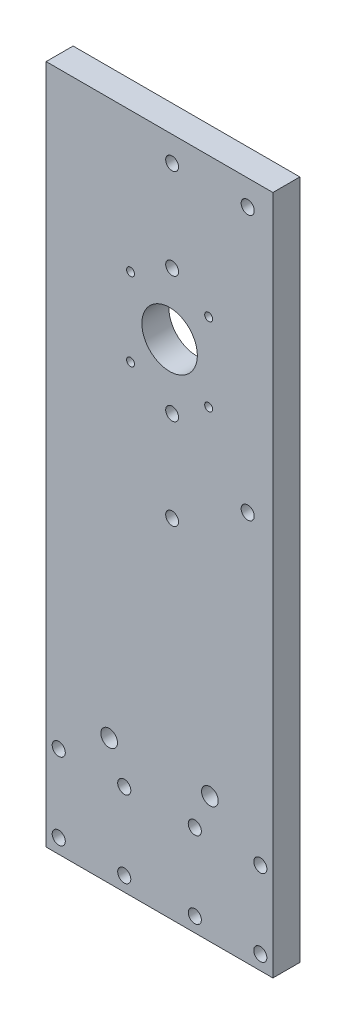
ISO-10303-21;
HEADER;
FILE_DESCRIPTION(('STEP AP214'),'2;1');
FILE_NAME('part.step','',(''),(''),'','','');
FILE_SCHEMA(('AUTOMOTIVE_DESIGN { 1 0 10303 214 1 1 1 1 }'));
ENDSEC;
DATA;
#1=APPLICATION_CONTEXT('core data for automotive mechanical design processes');
#2=APPLICATION_PROTOCOL_DEFINITION('international standard','automotive_design',2000,#1);
#3=PRODUCT_CONTEXT('',#1,'mechanical');
#4=PRODUCT('Part','Part','',(#3));
#5=PRODUCT_RELATED_PRODUCT_CATEGORY('part','',(#4));
#6=PRODUCT_DEFINITION_FORMATION('','',#4);
#7=PRODUCT_DEFINITION_CONTEXT('part definition',#1,'design');
#8=PRODUCT_DEFINITION('design','',#6,#7);
#9=PRODUCT_DEFINITION_SHAPE('','',#8);
#10=(LENGTH_UNIT() NAMED_UNIT(*) SI_UNIT(.MILLI.,.METRE.));
#11=(NAMED_UNIT(*) PLANE_ANGLE_UNIT() SI_UNIT($,.RADIAN.));
#12=(NAMED_UNIT(*) SI_UNIT($,.STERADIAN.) SOLID_ANGLE_UNIT());
#13=UNCERTAINTY_MEASURE_WITH_UNIT(LENGTH_MEASURE(1.E-05),#10,'distance_accuracy_value','');
#14=(GEOMETRIC_REPRESENTATION_CONTEXT(3) GLOBAL_UNCERTAINTY_ASSIGNED_CONTEXT((#13)) GLOBAL_UNIT_ASSIGNED_CONTEXT((#10,
#11,#12)) REPRESENTATION_CONTEXT('',''));
#15=CARTESIAN_POINT('',(0.,0.,0.));
#16=DIRECTION('',(0.,0.,1.));
#17=DIRECTION('',(1.,0.,0.));
#18=AXIS2_PLACEMENT_3D('',#15,#16,#17);
#19=CARTESIAN_POINT('',(0.,0.,0.));
#20=DIRECTION('',(0.,0.,1.));
#21=DIRECTION('',(1.,0.,0.));
#22=AXIS2_PLACEMENT_3D('',#19,#20,#21);
#23=PLANE('',#22);
#24=CARTESIAN_POINT('',(19.5,79.5,0.));
#25=DIRECTION('',(0.,0.,-1.));
#26=DIRECTION('',(-1.,0.,0.));
#27=AXIS2_PLACEMENT_3D('',#24,#25,#26);
#28=CIRCLE('',#27,1.575);
#29=CARTESIAN_POINT('',(17.925,79.5,0.));
#30=VERTEX_POINT('',#29);
#31=EDGE_CURVE('E239',#30,#30,#28,.T.);
#32=ORIENTED_EDGE('',*,*,#31,.F.);
#33=EDGE_LOOP('',(#32));
#34=FACE_BOUND('',#33,.T.);
#35=CARTESIAN_POINT('',(19.5,48.5,0.));
#36=DIRECTION('',(0.,0.,-1.));
#37=DIRECTION('',(-1.,0.,0.));
#38=AXIS2_PLACEMENT_3D('',#35,#36,#37);
#39=CIRCLE('',#38,1.575);
#40=CARTESIAN_POINT('',(17.925,48.5,0.));
#41=VERTEX_POINT('',#40);
#42=EDGE_CURVE('E233',#41,#41,#39,.T.);
#43=ORIENTED_EDGE('',*,*,#42,.F.);
#44=EDGE_LOOP('',(#43));
#45=FACE_BOUND('',#44,.T.);
#46=CARTESIAN_POINT('',(-11.5,79.5,0.));
#47=DIRECTION('',(0.,0.,-1.));
#48=DIRECTION('',(-1.,0.,0.));
#49=AXIS2_PLACEMENT_3D('',#46,#47,#48);
#50=CIRCLE('',#49,1.575);
#51=CARTESIAN_POINT('',(-13.075,79.5,0.));
#52=VERTEX_POINT('',#51);
#53=EDGE_CURVE('E227',#52,#52,#50,.T.);
#54=ORIENTED_EDGE('',*,*,#53,.F.);
#55=EDGE_LOOP('',(#54));
#56=FACE_BOUND('',#55,.T.);
#57=CARTESIAN_POINT('',(-11.5,48.5,0.));
#58=DIRECTION('',(0.,0.,-1.));
#59=DIRECTION('',(-1.,0.,0.));
#60=AXIS2_PLACEMENT_3D('',#57,#58,#59);
#61=CIRCLE('',#60,1.575);
#62=CARTESIAN_POINT('',(-13.075,48.5,0.));
#63=VERTEX_POINT('',#62);
#64=EDGE_CURVE('E221',#63,#63,#61,.T.);
#65=ORIENTED_EDGE('',*,*,#64,.F.);
#66=EDGE_LOOP('',(#65));
#67=FACE_BOUND('',#66,.T.);
#68=CARTESIAN_POINT('',(4.,64.,0.));
#69=DIRECTION('',(0.,0.,-1.));
#70=DIRECTION('',(-1.,0.,0.));
#71=AXIS2_PLACEMENT_3D('',#68,#69,#70);
#72=CIRCLE('',#71,11.);
#73=CARTESIAN_POINT('',(-7.,64.,0.));
#74=VERTEX_POINT('',#73);
#75=EDGE_CURVE('E213',#74,#74,#72,.T.);
#76=ORIENTED_EDGE('',*,*,#75,.F.);
#77=EDGE_LOOP('',(#76));
#78=FACE_BOUND('',#77,.T.);
#79=CARTESIAN_POINT('',(5.,125.,0.));
#80=DIRECTION('',(0.,0.,-1.));
#81=DIRECTION('',(-1.,0.,0.));
#82=AXIS2_PLACEMENT_3D('',#79,#80,#81);
#83=CIRCLE('',#82,2.5527);
#84=CARTESIAN_POINT('',(2.4473,125.,0.));
#85=VERTEX_POINT('',#84);
#86=EDGE_CURVE('E209',#85,#85,#83,.T.);
#87=ORIENTED_EDGE('',*,*,#86,.F.);
#88=EDGE_LOOP('',(#87));
#89=FACE_BOUND('',#88,.T.);
#90=CARTESIAN_POINT('',(5.,89.,0.));
#91=DIRECTION('',(0.,0.,-1.));
#92=DIRECTION('',(-1.,0.,0.));
#93=AXIS2_PLACEMENT_3D('',#90,#91,#92);
#94=CIRCLE('',#93,2.5527);
#95=CARTESIAN_POINT('',(2.4473,89.,0.));
#96=VERTEX_POINT('',#95);
#97=EDGE_CURVE('E203',#96,#96,#94,.T.);
#98=ORIENTED_EDGE('',*,*,#97,.F.);
#99=EDGE_LOOP('',(#98));
#100=FACE_BOUND('',#99,.T.);
#101=CARTESIAN_POINT('',(5.,39.,0.));
#102=DIRECTION('',(0.,0.,-1.));
#103=DIRECTION('',(-1.,0.,0.));
#104=AXIS2_PLACEMENT_3D('',#101,#102,#103);
#105=CIRCLE('',#104,2.5527);
#106=CARTESIAN_POINT('',(2.4473,39.,0.));
#107=VERTEX_POINT('',#106);
#108=EDGE_CURVE('E197',#107,#107,#105,.T.);
#109=ORIENTED_EDGE('',*,*,#108,.F.);
#110=EDGE_LOOP('',(#109));
#111=FACE_BOUND('',#110,.T.);
#112=CARTESIAN_POINT('',(5.,3.00000000000002,0.));
#113=DIRECTION('',(0.,0.,-1.));
#114=DIRECTION('',(-1.,0.,0.));
#115=AXIS2_PLACEMENT_3D('',#112,#113,#114);
#116=CIRCLE('',#115,2.5527);
#117=CARTESIAN_POINT('',(2.4473,3.00000000000002,0.));
#118=VERTEX_POINT('',#117);
#119=EDGE_CURVE('E191',#118,#118,#116,.T.);
#120=ORIENTED_EDGE('',*,*,#119,.F.);
#121=EDGE_LOOP('',(#120));
#122=FACE_BOUND('',#121,.T.);
#123=CARTESIAN_POINT('',(35.,20.,0.));
#124=DIRECTION('',(0.,0.,-1.));
#125=DIRECTION('',(-1.,0.,0.));
#126=AXIS2_PLACEMENT_3D('',#123,#124,#125);
#127=CIRCLE('',#126,2.6);
#128=CARTESIAN_POINT('',(32.4,20.,0.));
#129=VERTEX_POINT('',#128);
#130=EDGE_CURVE('E179',#129,#129,#127,.T.);
#131=ORIENTED_EDGE('',*,*,#130,.F.);
#132=EDGE_LOOP('',(#131));
#133=FACE_BOUND('',#132,.T.);
#134=CARTESIAN_POINT('',(20.,-85.,0.));
#135=DIRECTION('',(0.,0.,-1.));
#136=DIRECTION('',(-1.,0.,0.));
#137=AXIS2_PLACEMENT_3D('',#134,#135,#136);
#138=CIRCLE('',#137,3.3147);
#139=CARTESIAN_POINT('',(16.6853,-85.,0.));
#140=VERTEX_POINT('',#139);
#141=EDGE_CURVE('E173',#140,#140,#138,.T.);
#142=ORIENTED_EDGE('',*,*,#141,.F.);
#143=EDGE_LOOP('',(#142));
#144=FACE_BOUND('',#143,.T.);
#145=CARTESIAN_POINT('',(-20.,-85.,0.));
#146=DIRECTION('',(0.,0.,-1.));
#147=DIRECTION('',(-1.,0.,0.));
#148=AXIS2_PLACEMENT_3D('',#145,#146,#147);
#149=CIRCLE('',#148,3.3147);
#150=CARTESIAN_POINT('',(-23.3147,-85.,0.));
#151=VERTEX_POINT('',#150);
#152=EDGE_CURVE('E167',#151,#151,#149,.T.);
#153=ORIENTED_EDGE('',*,*,#152,.F.);
#154=EDGE_LOOP('',(#153));
#155=FACE_BOUND('',#154,.T.);
#156=CARTESIAN_POINT('',(40.,-98.75,0.));
#157=DIRECTION('',(0.,0.,-1.));
#158=DIRECTION('',(-1.,0.,0.));
#159=AXIS2_PLACEMENT_3D('',#156,#157,#158);
#160=CIRCLE('',#159,2.59999999999998);
#161=CARTESIAN_POINT('',(37.4,-98.75,0.));
#162=VERTEX_POINT('',#161);
#163=EDGE_CURVE('E161',#162,#162,#160,.T.);
#164=ORIENTED_EDGE('',*,*,#163,.F.);
#165=EDGE_LOOP('',(#164));
#166=FACE_BOUND('',#165,.T.);
#167=CARTESIAN_POINT('',(14.,-98.75,0.));
#168=DIRECTION('',(0.,0.,-1.));
#169=DIRECTION('',(-1.,0.,0.));
#170=AXIS2_PLACEMENT_3D('',#167,#168,#169);
#171=CIRCLE('',#170,2.59999999999999);
#172=CARTESIAN_POINT('',(11.4,-98.75,0.));
#173=VERTEX_POINT('',#172);
#174=EDGE_CURVE('E155',#173,#173,#171,.T.);
#175=ORIENTED_EDGE('',*,*,#174,.F.);
#176=EDGE_LOOP('',(#175));
#177=FACE_BOUND('',#176,.T.);
#178=CARTESIAN_POINT('',(40.,-129.25,0.));
#179=DIRECTION('',(0.,0.,-1.));
#180=DIRECTION('',(-1.,0.,0.));
#181=AXIS2_PLACEMENT_3D('',#178,#179,#180);
#182=CIRCLE('',#181,2.59999999999998);
#183=CARTESIAN_POINT('',(37.4,-129.25,0.));
#184=VERTEX_POINT('',#183);
#185=EDGE_CURVE('E149',#184,#184,#182,.T.);
#186=ORIENTED_EDGE('',*,*,#185,.F.);
#187=EDGE_LOOP('',(#186));
#188=FACE_BOUND('',#187,.T.);
#189=CARTESIAN_POINT('',(14.,-129.25,0.));
#190=DIRECTION('',(0.,0.,-1.));
#191=DIRECTION('',(-1.,0.,0.));
#192=AXIS2_PLACEMENT_3D('',#189,#190,#191);
#193=CIRCLE('',#192,2.59999999999999);
#194=CARTESIAN_POINT('',(11.4,-129.25,0.));
#195=VERTEX_POINT('',#194);
#196=EDGE_CURVE('E143',#195,#195,#193,.T.);
#197=ORIENTED_EDGE('',*,*,#196,.F.);
#198=EDGE_LOOP('',(#197));
#199=FACE_BOUND('',#198,.T.);
#200=CARTESIAN_POINT('',(-14.,-129.25,0.));
#201=DIRECTION('',(0.,0.,-1.));
#202=DIRECTION('',(-1.,0.,0.));
#203=AXIS2_PLACEMENT_3D('',#200,#201,#202);
#204=CIRCLE('',#203,2.59999999999999);
#205=CARTESIAN_POINT('',(-16.6,-129.25,0.));
#206=VERTEX_POINT('',#205);
#207=EDGE_CURVE('E137',#206,#206,#204,.T.);
#208=ORIENTED_EDGE('',*,*,#207,.F.);
#209=EDGE_LOOP('',(#208));
#210=FACE_BOUND('',#209,.T.);
#211=CARTESIAN_POINT('',(-40.,-129.25,0.));
#212=DIRECTION('',(0.,0.,-1.));
#213=DIRECTION('',(-1.,0.,0.));
#214=AXIS2_PLACEMENT_3D('',#211,#212,#213);
#215=CIRCLE('',#214,2.59999999999998);
#216=CARTESIAN_POINT('',(-42.6,-129.25,0.));
#217=VERTEX_POINT('',#216);
#218=EDGE_CURVE('E131',#217,#217,#215,.T.);
#219=ORIENTED_EDGE('',*,*,#218,.F.);
#220=EDGE_LOOP('',(#219));
#221=FACE_BOUND('',#220,.T.);
#222=CARTESIAN_POINT('',(-14.,-98.75,0.));
#223=DIRECTION('',(0.,0.,-1.));
#224=DIRECTION('',(-1.,0.,0.));
#225=AXIS2_PLACEMENT_3D('',#222,#223,#224);
#226=CIRCLE('',#225,2.59999999999999);
#227=CARTESIAN_POINT('',(-16.6,-98.75,0.));
#228=VERTEX_POINT('',#227);
#229=EDGE_CURVE('E125',#228,#228,#226,.T.);
#230=ORIENTED_EDGE('',*,*,#229,.F.);
#231=EDGE_LOOP('',(#230));
#232=FACE_BOUND('',#231,.T.);
#233=CARTESIAN_POINT('',(-40.,-98.7499999999999,0.));
#234=DIRECTION('',(0.,0.,-1.));
#235=DIRECTION('',(-1.,0.,0.));
#236=AXIS2_PLACEMENT_3D('',#233,#234,#235);
#237=CIRCLE('',#236,2.59999999999998);
#238=CARTESIAN_POINT('',(-42.6,-98.7499999999999,0.));
#239=VERTEX_POINT('',#238);
#240=EDGE_CURVE('E119',#239,#239,#237,.T.);
#241=ORIENTED_EDGE('',*,*,#240,.F.);
#242=EDGE_LOOP('',(#241));
#243=FACE_BOUND('',#242,.T.);
#244=DIRECTION('',(0.,-1.,0.));
#245=VECTOR('',#244,1.);
#246=CARTESIAN_POINT('',(-45.,-135.,0.));
#247=LINE('',#246,#245);
#248=CARTESIAN_POINT('',(-45.,135.,0.));
#249=VERTEX_POINT('',#248);
#250=CARTESIAN_POINT('',(-45.,-135.,0.));
#251=VERTEX_POINT('',#250);
#252=EDGE_CURVE('E103',#249,#251,#247,.T.);
#253=ORIENTED_EDGE('',*,*,#252,.F.);
#254=DIRECTION('',(-1.,0.,0.));
#255=VECTOR('',#254,1.);
#256=CARTESIAN_POINT('',(45.,135.,0.));
#257=LINE('',#256,#255);
#258=CARTESIAN_POINT('',(45.,135.,0.));
#259=VERTEX_POINT('',#258);
#260=EDGE_CURVE('E79',#259,#249,#257,.T.);
#261=ORIENTED_EDGE('',*,*,#260,.F.);
#262=DIRECTION('',(0.,1.,0.));
#263=VECTOR('',#262,1.);
#264=CARTESIAN_POINT('',(45.,-135.,0.));
#265=LINE('',#264,#263);
#266=CARTESIAN_POINT('',(45.,-135.,0.));
#267=VERTEX_POINT('',#266);
#268=EDGE_CURVE('E73',#267,#259,#265,.T.);
#269=ORIENTED_EDGE('',*,*,#268,.F.);
#270=DIRECTION('',(1.,0.,0.));
#271=VECTOR('',#270,1.);
#272=CARTESIAN_POINT('',(45.,-135.,0.));
#273=LINE('',#272,#271);
#274=EDGE_CURVE('E95',#251,#267,#273,.T.);
#275=ORIENTED_EDGE('',*,*,#274,.F.);
#276=EDGE_LOOP('',(#253,#261,#269,#275));
#277=FACE_BOUND('',#276,.T.);
#278=CARTESIAN_POINT('',(35.,125.,0.));
#279=DIRECTION('',(0.,0.,-1.));
#280=DIRECTION('',(-1.,0.,0.));
#281=AXIS2_PLACEMENT_3D('',#278,#279,#280);
#282=CIRCLE('',#281,2.6);
#283=CARTESIAN_POINT('',(32.4,125.,0.));
#284=VERTEX_POINT('',#283);
#285=EDGE_CURVE('E185',#284,#284,#282,.T.);
#286=ORIENTED_EDGE('',*,*,#285,.F.);
#287=EDGE_LOOP('',(#286));
#288=FACE_BOUND('',#287,.T.);
#289=ADVANCED_FACE('F39',(#34,#45,#56,#67,#78,#89,#100,#111,#122,#133,#144,#155,#166,#177,#188,
#199,#210,#221,#232,#243,#277,#288),#23,.F.);
#290=CARTESIAN_POINT('',(-45.,-135.,10.7));
#291=DIRECTION('',(1.,0.,0.));
#292=DIRECTION('',(0.,0.,-1.));
#293=AXIS2_PLACEMENT_3D('',#290,#291,#292);
#294=PLANE('',#293);
#295=ORIENTED_EDGE('',*,*,#252,.T.);
#296=DIRECTION('',(0.,0.,-1.));
#297=VECTOR('',#296,1.);
#298=CARTESIAN_POINT('',(-45.,-135.,10.7));
#299=LINE('',#298,#297);
#300=CARTESIAN_POINT('',(-45.,-135.,10.7));
#301=VERTEX_POINT('',#300);
#302=EDGE_CURVE('E11',#301,#251,#299,.T.);
#303=ORIENTED_EDGE('',*,*,#302,.F.);
#304=DIRECTION('',(0.,-1.,0.));
#305=VECTOR('',#304,1.);
#306=CARTESIAN_POINT('',(-45.,-135.,10.7));
#307=LINE('',#306,#305);
#308=CARTESIAN_POINT('',(-45.,135.,10.7));
#309=VERTEX_POINT('',#308);
#310=EDGE_CURVE('E91',#309,#301,#307,.T.);
#311=ORIENTED_EDGE('',*,*,#310,.F.);
#312=DIRECTION('',(0.,0.,-1.));
#313=VECTOR('',#312,1.);
#314=CARTESIAN_POINT('',(-45.,135.,10.7));
#315=LINE('',#314,#313);
#316=EDGE_CURVE('E99',#309,#249,#315,.T.);
#317=ORIENTED_EDGE('',*,*,#316,.T.);
#318=EDGE_LOOP('',(#295,#303,#311,#317));
#319=FACE_BOUND('',#318,.T.);
#320=ADVANCED_FACE('F41',(#319),#294,.F.);
#321=CARTESIAN_POINT('',(45.,-135.,10.7));
#322=DIRECTION('',(0.,1.,0.));
#323=DIRECTION('',(0.,0.,1.));
#324=AXIS2_PLACEMENT_3D('',#321,#322,#323);
#325=PLANE('',#324);
#326=ORIENTED_EDGE('',*,*,#274,.T.);
#327=DIRECTION('',(0.,0.,-1.));
#328=VECTOR('',#327,1.);
#329=CARTESIAN_POINT('',(45.,-135.,10.7));
#330=LINE('',#329,#328);
#331=CARTESIAN_POINT('',(45.,-135.,10.7));
#332=VERTEX_POINT('',#331);
#333=EDGE_CURVE('E48',#332,#267,#330,.T.);
#334=ORIENTED_EDGE('',*,*,#333,.F.);
#335=DIRECTION('',(1.,0.,0.));
#336=VECTOR('',#335,1.);
#337=CARTESIAN_POINT('',(45.,-135.,10.7));
#338=LINE('',#337,#336);
#339=EDGE_CURVE('E86',#301,#332,#338,.T.);
#340=ORIENTED_EDGE('',*,*,#339,.F.);
#341=ORIENTED_EDGE('',*,*,#302,.T.);
#342=EDGE_LOOP('',(#326,#334,#340,#341));
#343=FACE_BOUND('',#342,.T.);
#344=ADVANCED_FACE('F94',(#343),#325,.F.);
#345=CARTESIAN_POINT('',(45.,-135.,10.7));
#346=DIRECTION('',(-1.,0.,0.));
#347=DIRECTION('',(0.,0.,1.));
#348=AXIS2_PLACEMENT_3D('',#345,#346,#347);
#349=PLANE('',#348);
#350=ORIENTED_EDGE('',*,*,#268,.T.);
#351=DIRECTION('',(0.,0.,-1.));
#352=VECTOR('',#351,1.);
#353=CARTESIAN_POINT('',(45.,135.,10.7));
#354=LINE('',#353,#352);
#355=CARTESIAN_POINT('',(45.,135.,10.7));
#356=VERTEX_POINT('',#355);
#357=EDGE_CURVE('E96',#356,#259,#354,.T.);
#358=ORIENTED_EDGE('',*,*,#357,.F.);
#359=DIRECTION('',(0.,1.,0.));
#360=VECTOR('',#359,1.);
#361=CARTESIAN_POINT('',(45.,-135.,10.7));
#362=LINE('',#361,#360);
#363=EDGE_CURVE('E89',#332,#356,#362,.T.);
#364=ORIENTED_EDGE('',*,*,#363,.F.);
#365=ORIENTED_EDGE('',*,*,#333,.T.);
#366=EDGE_LOOP('',(#350,#358,#364,#365));
#367=FACE_BOUND('',#366,.T.);
#368=ADVANCED_FACE('F97',(#367),#349,.F.);
#369=CARTESIAN_POINT('',(45.,135.,10.7));
#370=DIRECTION('',(0.,-1.,0.));
#371=DIRECTION('',(0.,0.,-1.));
#372=AXIS2_PLACEMENT_3D('',#369,#370,#371);
#373=PLANE('',#372);
#374=ORIENTED_EDGE('',*,*,#260,.T.);
#375=ORIENTED_EDGE('',*,*,#316,.F.);
#376=DIRECTION('',(-1.,0.,0.));
#377=VECTOR('',#376,1.);
#378=CARTESIAN_POINT('',(45.,135.,10.7));
#379=LINE('',#378,#377);
#380=EDGE_CURVE('E56',#356,#309,#379,.T.);
#381=ORIENTED_EDGE('',*,*,#380,.F.);
#382=ORIENTED_EDGE('',*,*,#357,.T.);
#383=EDGE_LOOP('',(#374,#375,#381,#382));
#384=FACE_BOUND('',#383,.T.);
#385=ADVANCED_FACE('F111',(#384),#373,.F.);
#386=CARTESIAN_POINT('',(0.,0.,10.7));
#387=DIRECTION('',(0.,0.,1.));
#388=DIRECTION('',(1.,0.,0.));
#389=AXIS2_PLACEMENT_3D('',#386,#387,#388);
#390=PLANE('',#389);
#391=CARTESIAN_POINT('',(19.5,79.5,10.7));
#392=DIRECTION('',(0.,0.,-1.));
#393=DIRECTION('',(-1.,0.,0.));
#394=AXIS2_PLACEMENT_3D('',#391,#392,#393);
#395=CIRCLE('',#394,1.575);
#396=CARTESIAN_POINT('',(17.925,79.5,10.7));
#397=VERTEX_POINT('',#396);
#398=EDGE_CURVE('E236',#397,#397,#395,.T.);
#399=ORIENTED_EDGE('',*,*,#398,.T.);
#400=EDGE_LOOP('',(#399));
#401=FACE_BOUND('',#400,.T.);
#402=CARTESIAN_POINT('',(19.5,48.5,10.7));
#403=DIRECTION('',(0.,0.,-1.));
#404=DIRECTION('',(-1.,0.,0.));
#405=AXIS2_PLACEMENT_3D('',#402,#403,#404);
#406=CIRCLE('',#405,1.575);
#407=CARTESIAN_POINT('',(17.925,48.5,10.7));
#408=VERTEX_POINT('',#407);
#409=EDGE_CURVE('E230',#408,#408,#406,.T.);
#410=ORIENTED_EDGE('',*,*,#409,.T.);
#411=EDGE_LOOP('',(#410));
#412=FACE_BOUND('',#411,.T.);
#413=CARTESIAN_POINT('',(-11.5,79.5,10.7));
#414=DIRECTION('',(0.,0.,-1.));
#415=DIRECTION('',(-1.,0.,0.));
#416=AXIS2_PLACEMENT_3D('',#413,#414,#415);
#417=CIRCLE('',#416,1.575);
#418=CARTESIAN_POINT('',(-13.075,79.5,10.7));
#419=VERTEX_POINT('',#418);
#420=EDGE_CURVE('E224',#419,#419,#417,.T.);
#421=ORIENTED_EDGE('',*,*,#420,.T.);
#422=EDGE_LOOP('',(#421));
#423=FACE_BOUND('',#422,.T.);
#424=CARTESIAN_POINT('',(-11.5,48.5,10.7));
#425=DIRECTION('',(0.,0.,-1.));
#426=DIRECTION('',(-1.,0.,0.));
#427=AXIS2_PLACEMENT_3D('',#424,#425,#426);
#428=CIRCLE('',#427,1.575);
#429=CARTESIAN_POINT('',(-13.075,48.5,10.7));
#430=VERTEX_POINT('',#429);
#431=EDGE_CURVE('E216',#430,#430,#428,.T.);
#432=ORIENTED_EDGE('',*,*,#431,.T.);
#433=EDGE_LOOP('',(#432));
#434=FACE_BOUND('',#433,.T.);
#435=CARTESIAN_POINT('',(4.,64.,10.7));
#436=DIRECTION('',(0.,0.,-1.));
#437=DIRECTION('',(-1.,0.,0.));
#438=AXIS2_PLACEMENT_3D('',#435,#436,#437);
#439=CIRCLE('',#438,11.);
#440=CARTESIAN_POINT('',(-7.,64.,10.7));
#441=VERTEX_POINT('',#440);
#442=EDGE_CURVE('E212',#441,#441,#439,.T.);
#443=ORIENTED_EDGE('',*,*,#442,.T.);
#444=EDGE_LOOP('',(#443));
#445=FACE_BOUND('',#444,.T.);
#446=CARTESIAN_POINT('',(5.,125.,10.7));
#447=DIRECTION('',(0.,0.,-1.));
#448=DIRECTION('',(-1.,0.,0.));
#449=AXIS2_PLACEMENT_3D('',#446,#447,#448);
#450=CIRCLE('',#449,2.5527);
#451=CARTESIAN_POINT('',(2.4473,125.,10.7));
#452=VERTEX_POINT('',#451);
#453=EDGE_CURVE('E206',#452,#452,#450,.T.);
#454=ORIENTED_EDGE('',*,*,#453,.T.);
#455=EDGE_LOOP('',(#454));
#456=FACE_BOUND('',#455,.T.);
#457=CARTESIAN_POINT('',(5.,89.,10.7));
#458=DIRECTION('',(0.,0.,-1.));
#459=DIRECTION('',(-1.,0.,0.));
#460=AXIS2_PLACEMENT_3D('',#457,#458,#459);
#461=CIRCLE('',#460,2.5527);
#462=CARTESIAN_POINT('',(2.4473,89.,10.7));
#463=VERTEX_POINT('',#462);
#464=EDGE_CURVE('E200',#463,#463,#461,.T.);
#465=ORIENTED_EDGE('',*,*,#464,.T.);
#466=EDGE_LOOP('',(#465));
#467=FACE_BOUND('',#466,.T.);
#468=CARTESIAN_POINT('',(5.,39.,10.7));
#469=DIRECTION('',(0.,0.,-1.));
#470=DIRECTION('',(-1.,0.,0.));
#471=AXIS2_PLACEMENT_3D('',#468,#469,#470);
#472=CIRCLE('',#471,2.5527);
#473=CARTESIAN_POINT('',(2.4473,39.,10.7));
#474=VERTEX_POINT('',#473);
#475=EDGE_CURVE('E194',#474,#474,#472,.T.);
#476=ORIENTED_EDGE('',*,*,#475,.T.);
#477=EDGE_LOOP('',(#476));
#478=FACE_BOUND('',#477,.T.);
#479=CARTESIAN_POINT('',(5.,3.00000000000002,10.7));
#480=DIRECTION('',(0.,0.,-1.));
#481=DIRECTION('',(-1.,0.,0.));
#482=AXIS2_PLACEMENT_3D('',#479,#480,#481);
#483=CIRCLE('',#482,2.5527);
#484=CARTESIAN_POINT('',(2.4473,3.00000000000002,10.7));
#485=VERTEX_POINT('',#484);
#486=EDGE_CURVE('E188',#485,#485,#483,.T.);
#487=ORIENTED_EDGE('',*,*,#486,.T.);
#488=EDGE_LOOP('',(#487));
#489=FACE_BOUND('',#488,.T.);
#490=CARTESIAN_POINT('',(35.,125.,10.7));
#491=DIRECTION('',(0.,0.,-1.));
#492=DIRECTION('',(-1.,0.,0.));
#493=AXIS2_PLACEMENT_3D('',#490,#491,#492);
#494=CIRCLE('',#493,2.6);
#495=CARTESIAN_POINT('',(32.4,125.,10.7));
#496=VERTEX_POINT('',#495);
#497=EDGE_CURVE('E182',#496,#496,#494,.T.);
#498=ORIENTED_EDGE('',*,*,#497,.T.);
#499=EDGE_LOOP('',(#498));
#500=FACE_BOUND('',#499,.T.);
#501=CARTESIAN_POINT('',(35.,20.,10.7));
#502=DIRECTION('',(0.,0.,-1.));
#503=DIRECTION('',(-1.,0.,0.));
#504=AXIS2_PLACEMENT_3D('',#501,#502,#503);
#505=CIRCLE('',#504,2.6);
#506=CARTESIAN_POINT('',(32.4,20.,10.7));
#507=VERTEX_POINT('',#506);
#508=EDGE_CURVE('E176',#507,#507,#505,.T.);
#509=ORIENTED_EDGE('',*,*,#508,.T.);
#510=EDGE_LOOP('',(#509));
#511=FACE_BOUND('',#510,.T.);
#512=CARTESIAN_POINT('',(20.,-85.,10.7));
#513=DIRECTION('',(0.,0.,-1.));
#514=DIRECTION('',(-1.,0.,0.));
#515=AXIS2_PLACEMENT_3D('',#512,#513,#514);
#516=CIRCLE('',#515,3.3147);
#517=CARTESIAN_POINT('',(16.6853,-85.,10.7));
#518=VERTEX_POINT('',#517);
#519=EDGE_CURVE('E170',#518,#518,#516,.T.);
#520=ORIENTED_EDGE('',*,*,#519,.T.);
#521=EDGE_LOOP('',(#520));
#522=FACE_BOUND('',#521,.T.);
#523=CARTESIAN_POINT('',(-20.,-85.,10.7));
#524=DIRECTION('',(0.,0.,-1.));
#525=DIRECTION('',(-1.,0.,0.));
#526=AXIS2_PLACEMENT_3D('',#523,#524,#525);
#527=CIRCLE('',#526,3.3147);
#528=CARTESIAN_POINT('',(-23.3147,-85.,10.7));
#529=VERTEX_POINT('',#528);
#530=EDGE_CURVE('E164',#529,#529,#527,.T.);
#531=ORIENTED_EDGE('',*,*,#530,.T.);
#532=EDGE_LOOP('',(#531));
#533=FACE_BOUND('',#532,.T.);
#534=CARTESIAN_POINT('',(40.,-98.75,10.7));
#535=DIRECTION('',(0.,0.,-1.));
#536=DIRECTION('',(-1.,0.,0.));
#537=AXIS2_PLACEMENT_3D('',#534,#535,#536);
#538=CIRCLE('',#537,2.6);
#539=CARTESIAN_POINT('',(37.4,-98.75,10.7));
#540=VERTEX_POINT('',#539);
#541=EDGE_CURVE('E158',#540,#540,#538,.T.);
#542=ORIENTED_EDGE('',*,*,#541,.T.);
#543=EDGE_LOOP('',(#542));
#544=FACE_BOUND('',#543,.T.);
#545=CARTESIAN_POINT('',(14.,-98.75,10.7));
#546=DIRECTION('',(0.,0.,-1.));
#547=DIRECTION('',(-1.,0.,0.));
#548=AXIS2_PLACEMENT_3D('',#545,#546,#547);
#549=CIRCLE('',#548,2.6);
#550=CARTESIAN_POINT('',(11.4,-98.75,10.7));
#551=VERTEX_POINT('',#550);
#552=EDGE_CURVE('E152',#551,#551,#549,.T.);
#553=ORIENTED_EDGE('',*,*,#552,.T.);
#554=EDGE_LOOP('',(#553));
#555=FACE_BOUND('',#554,.T.);
#556=CARTESIAN_POINT('',(40.,-129.25,10.7));
#557=DIRECTION('',(0.,0.,-1.));
#558=DIRECTION('',(-1.,0.,0.));
#559=AXIS2_PLACEMENT_3D('',#556,#557,#558);
#560=CIRCLE('',#559,2.6);
#561=CARTESIAN_POINT('',(37.4,-129.25,10.7));
#562=VERTEX_POINT('',#561);
#563=EDGE_CURVE('E146',#562,#562,#560,.T.);
#564=ORIENTED_EDGE('',*,*,#563,.T.);
#565=EDGE_LOOP('',(#564));
#566=FACE_BOUND('',#565,.T.);
#567=CARTESIAN_POINT('',(14.,-129.25,10.7));
#568=DIRECTION('',(0.,0.,-1.));
#569=DIRECTION('',(-1.,0.,0.));
#570=AXIS2_PLACEMENT_3D('',#567,#568,#569);
#571=CIRCLE('',#570,2.6);
#572=CARTESIAN_POINT('',(11.4,-129.25,10.7));
#573=VERTEX_POINT('',#572);
#574=EDGE_CURVE('E140',#573,#573,#571,.T.);
#575=ORIENTED_EDGE('',*,*,#574,.T.);
#576=EDGE_LOOP('',(#575));
#577=FACE_BOUND('',#576,.T.);
#578=CARTESIAN_POINT('',(-14.,-129.25,10.7));
#579=DIRECTION('',(0.,0.,-1.));
#580=DIRECTION('',(-1.,0.,0.));
#581=AXIS2_PLACEMENT_3D('',#578,#579,#580);
#582=CIRCLE('',#581,2.6);
#583=CARTESIAN_POINT('',(-16.6,-129.25,10.7));
#584=VERTEX_POINT('',#583);
#585=EDGE_CURVE('E134',#584,#584,#582,.T.);
#586=ORIENTED_EDGE('',*,*,#585,.T.);
#587=EDGE_LOOP('',(#586));
#588=FACE_BOUND('',#587,.T.);
#589=CARTESIAN_POINT('',(-40.,-129.25,10.7));
#590=DIRECTION('',(0.,0.,-1.));
#591=DIRECTION('',(-1.,0.,0.));
#592=AXIS2_PLACEMENT_3D('',#589,#590,#591);
#593=CIRCLE('',#592,2.6);
#594=CARTESIAN_POINT('',(-42.6,-129.25,10.7));
#595=VERTEX_POINT('',#594);
#596=EDGE_CURVE('E128',#595,#595,#593,.T.);
#597=ORIENTED_EDGE('',*,*,#596,.T.);
#598=EDGE_LOOP('',(#597));
#599=FACE_BOUND('',#598,.T.);
#600=CARTESIAN_POINT('',(-14.,-98.75,10.7));
#601=DIRECTION('',(0.,0.,-1.));
#602=DIRECTION('',(-1.,0.,0.));
#603=AXIS2_PLACEMENT_3D('',#600,#601,#602);
#604=CIRCLE('',#603,2.6);
#605=CARTESIAN_POINT('',(-16.6,-98.75,10.7));
#606=VERTEX_POINT('',#605);
#607=EDGE_CURVE('E122',#606,#606,#604,.T.);
#608=ORIENTED_EDGE('',*,*,#607,.T.);
#609=EDGE_LOOP('',(#608));
#610=FACE_BOUND('',#609,.T.);
#611=CARTESIAN_POINT('',(-40.,-98.7499999999999,10.7));
#612=DIRECTION('',(0.,0.,-1.));
#613=DIRECTION('',(-1.,0.,0.));
#614=AXIS2_PLACEMENT_3D('',#611,#612,#613);
#615=CIRCLE('',#614,2.6);
#616=CARTESIAN_POINT('',(-42.6,-98.7499999999999,10.7));
#617=VERTEX_POINT('',#616);
#618=EDGE_CURVE('E106',#617,#617,#615,.T.);
#619=ORIENTED_EDGE('',*,*,#618,.T.);
#620=EDGE_LOOP('',(#619));
#621=FACE_BOUND('',#620,.T.);
#622=ORIENTED_EDGE('',*,*,#310,.T.);
#623=ORIENTED_EDGE('',*,*,#339,.T.);
#624=ORIENTED_EDGE('',*,*,#363,.T.);
#625=ORIENTED_EDGE('',*,*,#380,.T.);
#626=EDGE_LOOP('',(#622,#623,#624,#625));
#627=FACE_BOUND('',#626,.T.);
#628=ADVANCED_FACE('F87',(#401,#412,#423,#434,#445,#456,#467,#478,#489,#500,#511,#522,#533,#544,
#555,#566,#577,#588,#599,#610,#621,#627),#390,.T.);
#629=CARTESIAN_POINT('',(-40.,-98.7499999999999,0.));
#630=DIRECTION('',(0.,0.,-1.));
#631=DIRECTION('',(-1.,0.,0.));
#632=AXIS2_PLACEMENT_3D('',#629,#630,#631);
#633=CYLINDRICAL_SURFACE('',#632,2.59999999999999);
#634=ORIENTED_EDGE('',*,*,#618,.F.);
#635=EDGE_LOOP('',(#634));
#636=FACE_BOUND('',#635,.T.);
#637=ORIENTED_EDGE('',*,*,#240,.T.);
#638=EDGE_LOOP('',(#637));
#639=FACE_BOUND('',#638,.T.);
#640=ADVANCED_FACE('F286',(#636,#639),#633,.F.);
#641=CARTESIAN_POINT('',(-14.,-98.75,0.));
#642=DIRECTION('',(0.,0.,-1.));
#643=DIRECTION('',(-1.,0.,0.));
#644=AXIS2_PLACEMENT_3D('',#641,#642,#643);
#645=CYLINDRICAL_SURFACE('',#644,2.59999999999999);
#646=ORIENTED_EDGE('',*,*,#607,.F.);
#647=EDGE_LOOP('',(#646));
#648=FACE_BOUND('',#647,.T.);
#649=ORIENTED_EDGE('',*,*,#229,.T.);
#650=EDGE_LOOP('',(#649));
#651=FACE_BOUND('',#650,.T.);
#652=ADVANCED_FACE('F288',(#648,#651),#645,.F.);
#653=CARTESIAN_POINT('',(-40.,-129.25,0.));
#654=DIRECTION('',(0.,0.,-1.));
#655=DIRECTION('',(-1.,0.,0.));
#656=AXIS2_PLACEMENT_3D('',#653,#654,#655);
#657=CYLINDRICAL_SURFACE('',#656,2.59999999999999);
#658=ORIENTED_EDGE('',*,*,#596,.F.);
#659=EDGE_LOOP('',(#658));
#660=FACE_BOUND('',#659,.T.);
#661=ORIENTED_EDGE('',*,*,#218,.T.);
#662=EDGE_LOOP('',(#661));
#663=FACE_BOUND('',#662,.T.);
#664=ADVANCED_FACE('F295',(#660,#663),#657,.F.);
#665=CARTESIAN_POINT('',(-14.,-129.25,0.));
#666=DIRECTION('',(0.,0.,-1.));
#667=DIRECTION('',(-1.,0.,0.));
#668=AXIS2_PLACEMENT_3D('',#665,#666,#667);
#669=CYLINDRICAL_SURFACE('',#668,2.59999999999999);
#670=ORIENTED_EDGE('',*,*,#585,.F.);
#671=EDGE_LOOP('',(#670));
#672=FACE_BOUND('',#671,.T.);
#673=ORIENTED_EDGE('',*,*,#207,.T.);
#674=EDGE_LOOP('',(#673));
#675=FACE_BOUND('',#674,.T.);
#676=ADVANCED_FACE('F474',(#672,#675),#669,.F.);
#677=CARTESIAN_POINT('',(14.,-129.25,0.));
#678=DIRECTION('',(0.,0.,-1.));
#679=DIRECTION('',(-1.,0.,0.));
#680=AXIS2_PLACEMENT_3D('',#677,#678,#679);
#681=CYLINDRICAL_SURFACE('',#680,2.59999999999999);
#682=ORIENTED_EDGE('',*,*,#574,.F.);
#683=EDGE_LOOP('',(#682));
#684=FACE_BOUND('',#683,.T.);
#685=ORIENTED_EDGE('',*,*,#196,.T.);
#686=EDGE_LOOP('',(#685));
#687=FACE_BOUND('',#686,.T.);
#688=ADVANCED_FACE('F466',(#684,#687),#681,.F.);
#689=CARTESIAN_POINT('',(40.,-129.25,0.));
#690=DIRECTION('',(0.,0.,-1.));
#691=DIRECTION('',(-1.,0.,0.));
#692=AXIS2_PLACEMENT_3D('',#689,#690,#691);
#693=CYLINDRICAL_SURFACE('',#692,2.59999999999999);
#694=ORIENTED_EDGE('',*,*,#563,.F.);
#695=EDGE_LOOP('',(#694));
#696=FACE_BOUND('',#695,.T.);
#697=ORIENTED_EDGE('',*,*,#185,.T.);
#698=EDGE_LOOP('',(#697));
#699=FACE_BOUND('',#698,.T.);
#700=ADVANCED_FACE('F458',(#696,#699),#693,.F.);
#701=CARTESIAN_POINT('',(14.,-98.75,0.));
#702=DIRECTION('',(0.,0.,-1.));
#703=DIRECTION('',(-1.,0.,0.));
#704=AXIS2_PLACEMENT_3D('',#701,#702,#703);
#705=CYLINDRICAL_SURFACE('',#704,2.59999999999999);
#706=ORIENTED_EDGE('',*,*,#552,.F.);
#707=EDGE_LOOP('',(#706));
#708=FACE_BOUND('',#707,.T.);
#709=ORIENTED_EDGE('',*,*,#174,.T.);
#710=EDGE_LOOP('',(#709));
#711=FACE_BOUND('',#710,.T.);
#712=ADVANCED_FACE('F450',(#708,#711),#705,.F.);
#713=CARTESIAN_POINT('',(40.,-98.75,0.));
#714=DIRECTION('',(0.,0.,-1.));
#715=DIRECTION('',(-1.,0.,0.));
#716=AXIS2_PLACEMENT_3D('',#713,#714,#715);
#717=CYLINDRICAL_SURFACE('',#716,2.59999999999999);
#718=ORIENTED_EDGE('',*,*,#541,.F.);
#719=EDGE_LOOP('',(#718));
#720=FACE_BOUND('',#719,.T.);
#721=ORIENTED_EDGE('',*,*,#163,.T.);
#722=EDGE_LOOP('',(#721));
#723=FACE_BOUND('',#722,.T.);
#724=ADVANCED_FACE('F441',(#720,#723),#717,.F.);
#725=CARTESIAN_POINT('',(-20.,-85.,0.));
#726=DIRECTION('',(0.,0.,-1.));
#727=DIRECTION('',(-1.,0.,0.));
#728=AXIS2_PLACEMENT_3D('',#725,#726,#727);
#729=CYLINDRICAL_SURFACE('',#728,3.3147);
#730=ORIENTED_EDGE('',*,*,#530,.F.);
#731=EDGE_LOOP('',(#730));
#732=FACE_BOUND('',#731,.T.);
#733=ORIENTED_EDGE('',*,*,#152,.T.);
#734=EDGE_LOOP('',(#733));
#735=FACE_BOUND('',#734,.T.);
#736=ADVANCED_FACE('F432',(#732,#735),#729,.F.);
#737=CARTESIAN_POINT('',(20.,-85.,0.));
#738=DIRECTION('',(0.,0.,-1.));
#739=DIRECTION('',(-1.,0.,0.));
#740=AXIS2_PLACEMENT_3D('',#737,#738,#739);
#741=CYLINDRICAL_SURFACE('',#740,3.3147);
#742=ORIENTED_EDGE('',*,*,#519,.F.);
#743=EDGE_LOOP('',(#742));
#744=FACE_BOUND('',#743,.T.);
#745=ORIENTED_EDGE('',*,*,#141,.T.);
#746=EDGE_LOOP('',(#745));
#747=FACE_BOUND('',#746,.T.);
#748=ADVANCED_FACE('F423',(#744,#747),#741,.F.);
#749=CARTESIAN_POINT('',(35.,20.,0.));
#750=DIRECTION('',(0.,0.,-1.));
#751=DIRECTION('',(-1.,0.,0.));
#752=AXIS2_PLACEMENT_3D('',#749,#750,#751);
#753=CYLINDRICAL_SURFACE('',#752,2.6);
#754=ORIENTED_EDGE('',*,*,#508,.F.);
#755=EDGE_LOOP('',(#754));
#756=FACE_BOUND('',#755,.T.);
#757=ORIENTED_EDGE('',*,*,#130,.T.);
#758=EDGE_LOOP('',(#757));
#759=FACE_BOUND('',#758,.T.);
#760=ADVANCED_FACE('F415',(#756,#759),#753,.F.);
#761=CARTESIAN_POINT('',(35.,125.,0.));
#762=DIRECTION('',(0.,0.,-1.));
#763=DIRECTION('',(-1.,0.,0.));
#764=AXIS2_PLACEMENT_3D('',#761,#762,#763);
#765=CYLINDRICAL_SURFACE('',#764,2.6);
#766=ORIENTED_EDGE('',*,*,#497,.F.);
#767=EDGE_LOOP('',(#766));
#768=FACE_BOUND('',#767,.T.);
#769=ORIENTED_EDGE('',*,*,#285,.T.);
#770=EDGE_LOOP('',(#769));
#771=FACE_BOUND('',#770,.T.);
#772=ADVANCED_FACE('F406',(#768,#771),#765,.F.);
#773=CARTESIAN_POINT('',(5.,3.00000000000002,0.));
#774=DIRECTION('',(0.,0.,-1.));
#775=DIRECTION('',(-1.,0.,0.));
#776=AXIS2_PLACEMENT_3D('',#773,#774,#775);
#777=CYLINDRICAL_SURFACE('',#776,2.5527);
#778=ORIENTED_EDGE('',*,*,#486,.F.);
#779=EDGE_LOOP('',(#778));
#780=FACE_BOUND('',#779,.T.);
#781=ORIENTED_EDGE('',*,*,#119,.T.);
#782=EDGE_LOOP('',(#781));
#783=FACE_BOUND('',#782,.T.);
#784=ADVANCED_FACE('F398',(#780,#783),#777,.F.);
#785=CARTESIAN_POINT('',(5.,39.,0.));
#786=DIRECTION('',(0.,0.,-1.));
#787=DIRECTION('',(-1.,0.,0.));
#788=AXIS2_PLACEMENT_3D('',#785,#786,#787);
#789=CYLINDRICAL_SURFACE('',#788,2.5527);
#790=ORIENTED_EDGE('',*,*,#475,.F.);
#791=EDGE_LOOP('',(#790));
#792=FACE_BOUND('',#791,.T.);
#793=ORIENTED_EDGE('',*,*,#108,.T.);
#794=EDGE_LOOP('',(#793));
#795=FACE_BOUND('',#794,.T.);
#796=ADVANCED_FACE('F390',(#792,#795),#789,.F.);
#797=CARTESIAN_POINT('',(5.,89.,0.));
#798=DIRECTION('',(0.,0.,-1.));
#799=DIRECTION('',(-1.,0.,0.));
#800=AXIS2_PLACEMENT_3D('',#797,#798,#799);
#801=CYLINDRICAL_SURFACE('',#800,2.5527);
#802=ORIENTED_EDGE('',*,*,#464,.F.);
#803=EDGE_LOOP('',(#802));
#804=FACE_BOUND('',#803,.T.);
#805=ORIENTED_EDGE('',*,*,#97,.T.);
#806=EDGE_LOOP('',(#805));
#807=FACE_BOUND('',#806,.T.);
#808=ADVANCED_FACE('F382',(#804,#807),#801,.F.);
#809=CARTESIAN_POINT('',(5.,125.,0.));
#810=DIRECTION('',(0.,0.,-1.));
#811=DIRECTION('',(-1.,0.,0.));
#812=AXIS2_PLACEMENT_3D('',#809,#810,#811);
#813=CYLINDRICAL_SURFACE('',#812,2.5527);
#814=ORIENTED_EDGE('',*,*,#453,.F.);
#815=EDGE_LOOP('',(#814));
#816=FACE_BOUND('',#815,.T.);
#817=ORIENTED_EDGE('',*,*,#86,.T.);
#818=EDGE_LOOP('',(#817));
#819=FACE_BOUND('',#818,.T.);
#820=ADVANCED_FACE('F373',(#816,#819),#813,.F.);
#821=CARTESIAN_POINT('',(4.,64.,10.7));
#822=DIRECTION('',(0.,0.,-1.));
#823=DIRECTION('',(-1.,0.,0.));
#824=AXIS2_PLACEMENT_3D('',#821,#822,#823);
#825=CYLINDRICAL_SURFACE('',#824,11.);
#826=ORIENTED_EDGE('',*,*,#442,.F.);
#827=EDGE_LOOP('',(#826));
#828=FACE_BOUND('',#827,.T.);
#829=ORIENTED_EDGE('',*,*,#75,.T.);
#830=EDGE_LOOP('',(#829));
#831=FACE_BOUND('',#830,.T.);
#832=ADVANCED_FACE('F361',(#828,#831),#825,.F.);
#833=CARTESIAN_POINT('',(-11.5,48.5,0.));
#834=DIRECTION('',(0.,0.,-1.));
#835=DIRECTION('',(-1.,0.,0.));
#836=AXIS2_PLACEMENT_3D('',#833,#834,#835);
#837=CYLINDRICAL_SURFACE('',#836,1.575);
#838=ORIENTED_EDGE('',*,*,#431,.F.);
#839=EDGE_LOOP('',(#838));
#840=FACE_BOUND('',#839,.T.);
#841=ORIENTED_EDGE('',*,*,#64,.T.);
#842=EDGE_LOOP('',(#841));
#843=FACE_BOUND('',#842,.T.);
#844=ADVANCED_FACE('F350',(#840,#843),#837,.F.);
#845=CARTESIAN_POINT('',(-11.5,79.5,0.));
#846=DIRECTION('',(0.,0.,-1.));
#847=DIRECTION('',(-1.,0.,0.));
#848=AXIS2_PLACEMENT_3D('',#845,#846,#847);
#849=CYLINDRICAL_SURFACE('',#848,1.575);
#850=ORIENTED_EDGE('',*,*,#420,.F.);
#851=EDGE_LOOP('',(#850));
#852=FACE_BOUND('',#851,.T.);
#853=ORIENTED_EDGE('',*,*,#53,.T.);
#854=EDGE_LOOP('',(#853));
#855=FACE_BOUND('',#854,.T.);
#856=ADVANCED_FACE('F340',(#852,#855),#849,.F.);
#857=CARTESIAN_POINT('',(19.5,48.5,0.));
#858=DIRECTION('',(0.,0.,-1.));
#859=DIRECTION('',(-1.,0.,0.));
#860=AXIS2_PLACEMENT_3D('',#857,#858,#859);
#861=CYLINDRICAL_SURFACE('',#860,1.575);
#862=ORIENTED_EDGE('',*,*,#409,.F.);
#863=EDGE_LOOP('',(#862));
#864=FACE_BOUND('',#863,.T.);
#865=ORIENTED_EDGE('',*,*,#42,.T.);
#866=EDGE_LOOP('',(#865));
#867=FACE_BOUND('',#866,.T.);
#868=ADVANCED_FACE('F327',(#864,#867),#861,.F.);
#869=CARTESIAN_POINT('',(19.5,79.5,0.));
#870=DIRECTION('',(0.,0.,-1.));
#871=DIRECTION('',(-1.,0.,0.));
#872=AXIS2_PLACEMENT_3D('',#869,#870,#871);
#873=CYLINDRICAL_SURFACE('',#872,1.575);
#874=ORIENTED_EDGE('',*,*,#398,.F.);
#875=EDGE_LOOP('',(#874));
#876=FACE_BOUND('',#875,.T.);
#877=ORIENTED_EDGE('',*,*,#31,.T.);
#878=EDGE_LOOP('',(#877));
#879=FACE_BOUND('',#878,.T.);
#880=ADVANCED_FACE('F243',(#876,#879),#873,.F.);
#881=CLOSED_SHELL('',(#289,#320,#344,#368,#385,#628,#640,#652,#664,#676,#688,#700,#712,#724,
#736,#748,#760,#772,#784,#796,#808,#820,#832,#844,#856,#868,#880));
#882=MANIFOLD_SOLID_BREP('B2',#881);
#883=ADVANCED_BREP_SHAPE_REPRESENTATION('',(#18,#882),#14);
#884=SHAPE_DEFINITION_REPRESENTATION(#9,#883);
ENDSEC;
END-ISO-10303-21;
